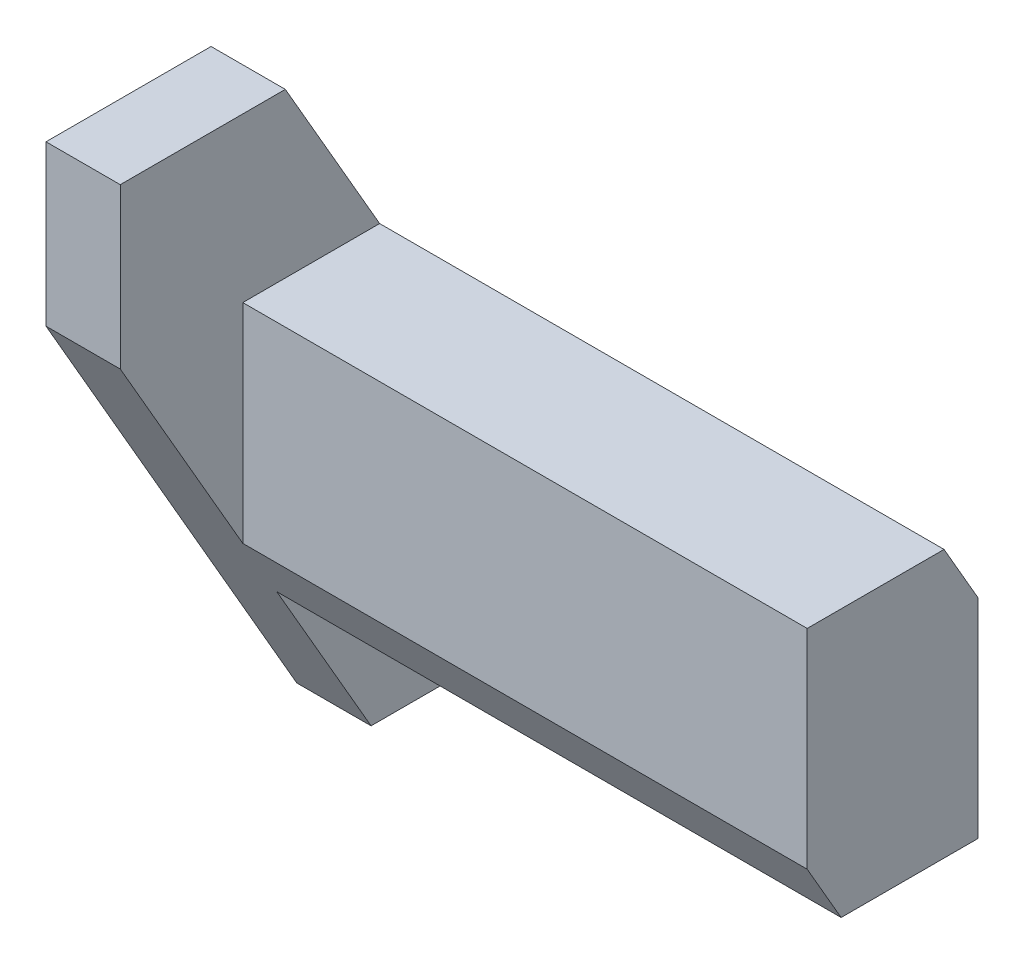
ISO-10303-21;
HEADER;
FILE_DESCRIPTION(('STEP AP214'),'2;1');
FILE_NAME('part.step','',(''),(''),'','','');
FILE_SCHEMA(('AUTOMOTIVE_DESIGN { 1 0 10303 214 1 1 1 1 }'));
ENDSEC;
DATA;
#1=APPLICATION_CONTEXT('core data for automotive mechanical design processes');
#2=APPLICATION_PROTOCOL_DEFINITION('international standard','automotive_design',2000,#1);
#3=PRODUCT_CONTEXT('',#1,'mechanical');
#4=PRODUCT('Part','Part','',(#3));
#5=PRODUCT_RELATED_PRODUCT_CATEGORY('part','',(#4));
#6=PRODUCT_DEFINITION_FORMATION('','',#4);
#7=PRODUCT_DEFINITION_CONTEXT('part definition',#1,'design');
#8=PRODUCT_DEFINITION('design','',#6,#7);
#9=PRODUCT_DEFINITION_SHAPE('','',#8);
#10=(LENGTH_UNIT() NAMED_UNIT(*) SI_UNIT(.MILLI.,.METRE.));
#11=(NAMED_UNIT(*) PLANE_ANGLE_UNIT() SI_UNIT($,.RADIAN.));
#12=(NAMED_UNIT(*) SI_UNIT($,.STERADIAN.) SOLID_ANGLE_UNIT());
#13=UNCERTAINTY_MEASURE_WITH_UNIT(LENGTH_MEASURE(1.E-05),#10,'distance_accuracy_value','');
#14=(GEOMETRIC_REPRESENTATION_CONTEXT(3) GLOBAL_UNCERTAINTY_ASSIGNED_CONTEXT((#13)) GLOBAL_UNIT_ASSIGNED_CONTEXT((#10,
#11,#12)) REPRESENTATION_CONTEXT('',''));
#15=CARTESIAN_POINT('',(0.,0.,0.));
#16=DIRECTION('',(0.,0.,1.));
#17=DIRECTION('',(1.,0.,0.));
#18=AXIS2_PLACEMENT_3D('',#15,#16,#17);
#19=CARTESIAN_POINT('',(0.,0.,0.));
#20=DIRECTION('',(1.,0.,0.));
#21=DIRECTION('',(0.,0.,-1.));
#22=AXIS2_PLACEMENT_3D('',#19,#20,#21);
#23=PLANE('',#22);
#24=DIRECTION('',(0.,-1.,0.));
#25=VECTOR('',#24,1.);
#26=CARTESIAN_POINT('',(0.,-10.0814157129578,11.5));
#27=LINE('',#26,#25);
#28=CARTESIAN_POINT('',(0.,18.,11.5));
#29=VERTEX_POINT('',#28);
#30=CARTESIAN_POINT('',(0.,-10.081415712958,11.5));
#31=VERTEX_POINT('',#30);
#32=EDGE_CURVE('E49',#29,#31,#27,.T.);
#33=ORIENTED_EDGE('',*,*,#32,.F.);
#34=DIRECTION('',(0.,0.,1.));
#35=VECTOR('',#34,1.);
#36=CARTESIAN_POINT('',(0.,18.,-6.92820323027544));
#37=LINE('',#36,#35);
#38=CARTESIAN_POINT('',(0.,18.,-6.92820323027556));
#39=VERTEX_POINT('',#38);
#40=EDGE_CURVE('E161',#39,#29,#37,.T.);
#41=ORIENTED_EDGE('',*,*,#40,.F.);
#42=DIRECTION('',(0.,0.86602540378444,0.499999999999998));
#43=VECTOR('',#42,1.);
#44=CARTESIAN_POINT('',(0.,-18.4974226119287,-28.));
#45=LINE('',#44,#43);
#46=CARTESIAN_POINT('',(0.,40.,5.77350269189616));
#47=VERTEX_POINT('',#46);
#48=EDGE_CURVE('E200',#39,#47,#45,.T.);
#49=ORIENTED_EDGE('',*,*,#48,.T.);
#50=DIRECTION('',(0.,0.,1.));
#51=VECTOR('',#50,1.);
#52=CARTESIAN_POINT('',(0.,40.,5.77350269189616));
#53=LINE('',#52,#51);
#54=CARTESIAN_POINT('',(0.,40.,28.));
#55=VERTEX_POINT('',#54);
#56=EDGE_CURVE('E210',#47,#55,#53,.T.);
#57=ORIENTED_EDGE('',*,*,#56,.T.);
#58=DIRECTION('',(0.,-1.,0.));
#59=VECTOR('',#58,1.);
#60=CARTESIAN_POINT('',(0.,18.4974226119287,28.));
#61=LINE('',#60,#59);
#62=CARTESIAN_POINT('',(0.,18.4974226119287,28.));
#63=VERTEX_POINT('',#62);
#64=EDGE_CURVE('E213',#55,#63,#61,.T.);
#65=ORIENTED_EDGE('',*,*,#64,.T.);
#66=DIRECTION('',(0.,-0.86602540378444,-0.499999999999998));
#67=VECTOR('',#66,1.);
#68=CARTESIAN_POINT('',(0.,-40.,-5.77350269189616));
#69=LINE('',#68,#67);
#70=EDGE_CURVE('E217',#63,#31,#69,.T.);
#71=ORIENTED_EDGE('',*,*,#70,.T.);
#72=EDGE_LOOP('',(#33,#41,#49,#57,#65,#71));
#73=FACE_BOUND('',#72,.T.);
#74=ADVANCED_FACE('F34',(#73),#23,.T.);
#75=CARTESIAN_POINT('',(-24.,-18.4974226119287,-28.));
#76=DIRECTION('',(0.,0.499999999999998,-0.86602540378444));
#77=DIRECTION('',(0.,0.86602540378444,0.499999999999998));
#78=AXIS2_PLACEMENT_3D('',#75,#76,#77);
#79=PLANE('',#78);
#80=DIRECTION('',(0.,-0.86602540378444,-0.499999999999998));
#81=VECTOR('',#80,1.);
#82=CARTESIAN_POINT('',(-9.99999999999999,-18.4974226119287,-28.));
#83=LINE('',#82,#81);
#84=CARTESIAN_POINT('',(-10.,40.,5.77350269189616));
#85=VERTEX_POINT('',#84);
#86=CARTESIAN_POINT('',(-9.99999999999999,-18.4974226119287,-28.));
#87=VERTEX_POINT('',#86);
#88=EDGE_CURVE('E198',#85,#87,#83,.T.);
#89=ORIENTED_EDGE('',*,*,#88,.F.);
#90=DIRECTION('',(1.,0.,0.));
#91=VECTOR('',#90,1.);
#92=CARTESIAN_POINT('',(-24.,40.,5.77350269189616));
#93=LINE('',#92,#91);
#94=EDGE_CURVE('E207',#85,#47,#93,.T.);
#95=ORIENTED_EDGE('',*,*,#94,.T.);
#96=ORIENTED_EDGE('',*,*,#48,.F.);
#97=DIRECTION('',(-1.,0.,0.));
#98=VECTOR('',#97,1.);
#99=CARTESIAN_POINT('',(76.,18.,-6.92820323027544));
#100=LINE('',#99,#98);
#101=CARTESIAN_POINT('',(76.,18.,-6.92820323027544));
#102=VERTEX_POINT('',#101);
#103=EDGE_CURVE('E255',#102,#39,#100,.T.);
#104=ORIENTED_EDGE('',*,*,#103,.F.);
#105=DIRECTION('',(0.,0.866025403784438,0.5));
#106=VECTOR('',#105,1.);
#107=CARTESIAN_POINT('',(76.,18.,-6.92820323027544));
#108=LINE('',#107,#106);
#109=CARTESIAN_POINT('',(76.,10.0814157129577,-11.5));
#110=VERTEX_POINT('',#109);
#111=EDGE_CURVE('E271',#110,#102,#108,.T.);
#112=ORIENTED_EDGE('',*,*,#111,.F.);
#113=DIRECTION('',(-1.,0.,0.));
#114=VECTOR('',#113,1.);
#115=CARTESIAN_POINT('',(76.,10.0814157129577,-11.5));
#116=LINE('',#115,#114);
#117=CARTESIAN_POINT('',(0.,10.0814157129579,-11.5));
#118=VERTEX_POINT('',#117);
#119=EDGE_CURVE('E257',#110,#118,#116,.T.);
#120=ORIENTED_EDGE('',*,*,#119,.T.);
#121=CARTESIAN_POINT('',(0.,-18.4974226119287,-28.));
#122=VERTEX_POINT('',#121);
#123=EDGE_CURVE('E208',#122,#118,#45,.T.);
#124=ORIENTED_EDGE('',*,*,#123,.F.);
#125=DIRECTION('',(1.,0.,0.));
#126=VECTOR('',#125,1.);
#127=CARTESIAN_POINT('',(-24.,-18.4974226119287,-28.));
#128=LINE('',#127,#126);
#129=EDGE_CURVE('E42',#87,#122,#128,.T.);
#130=ORIENTED_EDGE('',*,*,#129,.F.);
#131=EDGE_LOOP('',(#89,#95,#96,#104,#112,#120,#124,#130));
#132=FACE_BOUND('',#131,.T.);
#133=ADVANCED_FACE('F36',(#132),#79,.T.);
#134=CARTESIAN_POINT('',(-24.,-40.,-28.));
#135=DIRECTION('',(0.,0.,-1.));
#136=DIRECTION('',(0.,1.,0.));
#137=AXIS2_PLACEMENT_3D('',#134,#135,#136);
#138=PLANE('',#137);
#139=DIRECTION('',(0.,1.,0.));
#140=VECTOR('',#139,1.);
#141=CARTESIAN_POINT('',(-10.,40.,-28.));
#142=LINE('',#141,#140);
#143=CARTESIAN_POINT('',(-9.99999999999999,-20.,-28.));
#144=VERTEX_POINT('',#143);
#145=EDGE_CURVE('E182',#144,#87,#142,.T.);
#146=ORIENTED_EDGE('',*,*,#145,.T.);
#147=ORIENTED_EDGE('',*,*,#129,.T.);
#148=DIRECTION('',(0.,1.,0.));
#149=VECTOR('',#148,1.);
#150=CARTESIAN_POINT('',(0.,-40.,-28.));
#151=LINE('',#150,#149);
#152=CARTESIAN_POINT('',(0.,-40.,-28.));
#153=VERTEX_POINT('',#152);
#154=EDGE_CURVE('E204',#153,#122,#151,.T.);
#155=ORIENTED_EDGE('',*,*,#154,.F.);
#156=DIRECTION('',(1.,0.,0.));
#157=VECTOR('',#156,1.);
#158=CARTESIAN_POINT('',(-24.,-40.,-28.));
#159=LINE('',#158,#157);
#160=CARTESIAN_POINT('',(-24.,-40.,-28.));
#161=VERTEX_POINT('',#160);
#162=EDGE_CURVE('E225',#161,#153,#159,.T.);
#163=ORIENTED_EDGE('',*,*,#162,.F.);
#164=DIRECTION('',(0.,1.,0.));
#165=VECTOR('',#164,1.);
#166=CARTESIAN_POINT('',(-24.,-40.,-28.));
#167=LINE('',#166,#165);
#168=CARTESIAN_POINT('',(-24.,-24.,-28.));
#169=VERTEX_POINT('',#168);
#170=EDGE_CURVE('E203',#161,#169,#167,.T.);
#171=ORIENTED_EDGE('',*,*,#170,.T.);
#172=DIRECTION('',(0.961523947640823,0.274721127897378,0.));
#173=VECTOR('',#172,1.);
#174=CARTESIAN_POINT('',(-9.99999999999999,-20.,-28.));
#175=LINE('',#174,#173);
#176=EDGE_CURVE('E179',#169,#144,#175,.T.);
#177=ORIENTED_EDGE('',*,*,#176,.T.);
#178=EDGE_LOOP('',(#146,#147,#155,#163,#171,#177));
#179=FACE_BOUND('',#178,.T.);
#180=ADVANCED_FACE('F291',(#179),#138,.T.);
#181=CARTESIAN_POINT('',(-24.,-40.,-5.77350269189616));
#182=DIRECTION('',(0.,-1.,0.));
#183=DIRECTION('',(0.,0.,-1.));
#184=AXIS2_PLACEMENT_3D('',#181,#182,#183);
#185=PLANE('',#184);
#186=DIRECTION('',(0.,0.,1.));
#187=VECTOR('',#186,1.);
#188=CARTESIAN_POINT('',(-9.99999999999999,-40.,-5.77350269189616));
#189=LINE('',#188,#187);
#190=CARTESIAN_POINT('',(-9.99999999999999,-40.,-8.));
#191=VERTEX_POINT('',#190);
#192=CARTESIAN_POINT('',(-9.99999999999999,-40.,-5.77350269189616));
#193=VERTEX_POINT('',#192);
#194=EDGE_CURVE('E176',#191,#193,#189,.T.);
#195=ORIENTED_EDGE('',*,*,#194,.F.);
#196=DIRECTION('',(0.961523947640823,0.,0.274721127897378));
#197=VECTOR('',#196,1.);
#198=CARTESIAN_POINT('',(-22.3552648620103,-40.,-11.5300756748601));
#199=LINE('',#198,#197);
#200=CARTESIAN_POINT('',(-24.,-40.,-12.));
#201=VERTEX_POINT('',#200);
#202=EDGE_CURVE('E173',#201,#191,#199,.T.);
#203=ORIENTED_EDGE('',*,*,#202,.F.);
#204=DIRECTION('',(0.,0.,-1.));
#205=VECTOR('',#204,1.);
#206=CARTESIAN_POINT('',(-24.,-40.,-5.77350269189616));
#207=LINE('',#206,#205);
#208=EDGE_CURVE('E201',#201,#161,#207,.T.);
#209=ORIENTED_EDGE('',*,*,#208,.T.);
#210=ORIENTED_EDGE('',*,*,#162,.T.);
#211=DIRECTION('',(0.,0.,-1.));
#212=VECTOR('',#211,1.);
#213=CARTESIAN_POINT('',(0.,-40.,-5.77350269189616));
#214=LINE('',#213,#212);
#215=CARTESIAN_POINT('',(0.,-40.,-5.77350269189616));
#216=VERTEX_POINT('',#215);
#217=EDGE_CURVE('E219',#216,#153,#214,.T.);
#218=ORIENTED_EDGE('',*,*,#217,.F.);
#219=DIRECTION('',(1.,0.,0.));
#220=VECTOR('',#219,1.);
#221=CARTESIAN_POINT('',(-24.,-40.,-5.77350269189616));
#222=LINE('',#221,#220);
#223=EDGE_CURVE('E227',#193,#216,#222,.T.);
#224=ORIENTED_EDGE('',*,*,#223,.F.);
#225=EDGE_LOOP('',(#195,#203,#209,#210,#218,#224));
#226=FACE_BOUND('',#225,.T.);
#227=ADVANCED_FACE('F318',(#226),#185,.T.);
#228=CARTESIAN_POINT('',(-24.,-40.,-5.77350269189616));
#229=DIRECTION('',(0.,-0.499999999999998,0.86602540378444));
#230=DIRECTION('',(0.,-0.86602540378444,-0.499999999999998));
#231=AXIS2_PLACEMENT_3D('',#228,#229,#230);
#232=PLANE('',#231);
#233=DIRECTION('',(0.,0.86602540378444,0.499999999999998));
#234=VECTOR('',#233,1.);
#235=CARTESIAN_POINT('',(-9.99999999999999,-40.,-5.77350269189616));
#236=LINE('',#235,#234);
#237=CARTESIAN_POINT('',(-10.,18.4974226119287,28.));
#238=VERTEX_POINT('',#237);
#239=EDGE_CURVE('E196',#193,#238,#236,.T.);
#240=ORIENTED_EDGE('',*,*,#239,.F.);
#241=ORIENTED_EDGE('',*,*,#223,.T.);
#242=CARTESIAN_POINT('',(0.,-18.,6.92820323027554));
#243=VERTEX_POINT('',#242);
#244=EDGE_CURVE('E216',#243,#216,#69,.T.);
#245=ORIENTED_EDGE('',*,*,#244,.F.);
#246=DIRECTION('',(-1.,0.,0.));
#247=VECTOR('',#246,1.);
#248=CARTESIAN_POINT('',(76.,-18.,6.92820323027544));
#249=LINE('',#248,#247);
#250=CARTESIAN_POINT('',(76.,-18.,6.92820323027544));
#251=VERTEX_POINT('',#250);
#252=EDGE_CURVE('E148',#251,#243,#249,.T.);
#253=ORIENTED_EDGE('',*,*,#252,.F.);
#254=DIRECTION('',(0.,-0.866025403784439,-0.5));
#255=VECTOR('',#254,1.);
#256=CARTESIAN_POINT('',(76.,-10.0814157129578,11.5));
#257=LINE('',#256,#255);
#258=CARTESIAN_POINT('',(76.,-10.0814157129578,11.5));
#259=VERTEX_POINT('',#258);
#260=EDGE_CURVE('E141',#259,#251,#257,.T.);
#261=ORIENTED_EDGE('',*,*,#260,.F.);
#262=DIRECTION('',(-1.,0.,0.));
#263=VECTOR('',#262,1.);
#264=CARTESIAN_POINT('',(76.,-10.0814157129578,11.5));
#265=LINE('',#264,#263);
#266=EDGE_CURVE('E146',#259,#31,#265,.T.);
#267=ORIENTED_EDGE('',*,*,#266,.T.);
#268=ORIENTED_EDGE('',*,*,#70,.F.);
#269=DIRECTION('',(1.,0.,0.));
#270=VECTOR('',#269,1.);
#271=CARTESIAN_POINT('',(-24.,18.4974226119287,28.));
#272=LINE('',#271,#270);
#273=EDGE_CURVE('E230',#238,#63,#272,.T.);
#274=ORIENTED_EDGE('',*,*,#273,.F.);
#275=EDGE_LOOP('',(#240,#241,#245,#253,#261,#267,#268,#274));
#276=FACE_BOUND('',#275,.T.);
#277=ADVANCED_FACE('F143',(#276),#232,.T.);
#278=CARTESIAN_POINT('',(-24.,18.4974226119287,28.));
#279=DIRECTION('',(0.,0.,1.));
#280=DIRECTION('',(0.,-1.,0.));
#281=AXIS2_PLACEMENT_3D('',#278,#279,#280);
#282=PLANE('',#281);
#283=DIRECTION('',(0.,1.,0.));
#284=VECTOR('',#283,1.);
#285=CARTESIAN_POINT('',(-10.,18.4974226119287,28.));
#286=LINE('',#285,#284);
#287=CARTESIAN_POINT('',(-10.,40.,28.));
#288=VERTEX_POINT('',#287);
#289=EDGE_CURVE('E189',#238,#288,#286,.T.);
#290=ORIENTED_EDGE('',*,*,#289,.F.);
#291=ORIENTED_EDGE('',*,*,#273,.T.);
#292=ORIENTED_EDGE('',*,*,#64,.F.);
#293=DIRECTION('',(1.,0.,0.));
#294=VECTOR('',#293,1.);
#295=CARTESIAN_POINT('',(-24.,40.,28.));
#296=LINE('',#295,#294);
#297=EDGE_CURVE('E232',#288,#55,#296,.T.);
#298=ORIENTED_EDGE('',*,*,#297,.F.);
#299=EDGE_LOOP('',(#290,#291,#292,#298));
#300=FACE_BOUND('',#299,.T.);
#301=ADVANCED_FACE('F311',(#300),#282,.T.);
#302=CARTESIAN_POINT('',(-24.,40.,5.77350269189616));
#303=DIRECTION('',(0.,1.,0.));
#304=DIRECTION('',(0.,0.,1.));
#305=AXIS2_PLACEMENT_3D('',#302,#303,#304);
#306=PLANE('',#305);
#307=DIRECTION('',(0.,0.,1.));
#308=VECTOR('',#307,1.);
#309=CARTESIAN_POINT('',(-10.,40.,-28.));
#310=LINE('',#309,#308);
#311=EDGE_CURVE('E186',#85,#288,#310,.T.);
#312=ORIENTED_EDGE('',*,*,#311,.T.);
#313=ORIENTED_EDGE('',*,*,#297,.T.);
#314=ORIENTED_EDGE('',*,*,#56,.F.);
#315=ORIENTED_EDGE('',*,*,#94,.F.);
#316=EDGE_LOOP('',(#312,#313,#314,#315));
#317=FACE_BOUND('',#316,.T.);
#318=ADVANCED_FACE('F243',(#317),#306,.T.);
#319=CARTESIAN_POINT('',(-24.,0.,0.));
#320=DIRECTION('',(1.,0.,0.));
#321=DIRECTION('',(0.,0.,-1.));
#322=AXIS2_PLACEMENT_3D('',#319,#320,#321);
#323=PLANE('',#322);
#324=ORIENTED_EDGE('',*,*,#208,.F.);
#325=DIRECTION('',(0.,-1.,0.));
#326=VECTOR('',#325,1.);
#327=CARTESIAN_POINT('',(-24.,40.,-12.));
#328=LINE('',#327,#326);
#329=CARTESIAN_POINT('',(-24.,-24.,-12.));
#330=VERTEX_POINT('',#329);
#331=EDGE_CURVE('E164',#330,#201,#328,.T.);
#332=ORIENTED_EDGE('',*,*,#331,.F.);
#333=DIRECTION('',(0.,0.,1.));
#334=VECTOR('',#333,1.);
#335=CARTESIAN_POINT('',(-24.,-24.,-28.));
#336=LINE('',#335,#334);
#337=EDGE_CURVE('E185',#169,#330,#336,.T.);
#338=ORIENTED_EDGE('',*,*,#337,.F.);
#339=ORIENTED_EDGE('',*,*,#170,.F.);
#340=EDGE_LOOP('',(#324,#332,#338,#339));
#341=FACE_BOUND('',#340,.T.);
#342=ADVANCED_FACE('F296',(#341),#323,.F.);
#343=DIRECTION('',(0.,1.,0.));
#344=VECTOR('',#343,1.);
#345=CARTESIAN_POINT('',(0.,-18.,-11.5));
#346=LINE('',#345,#344);
#347=CARTESIAN_POINT('',(0.,-18.,-11.5));
#348=VERTEX_POINT('',#347);
#349=EDGE_CURVE('E247',#348,#118,#346,.T.);
#350=ORIENTED_EDGE('',*,*,#349,.F.);
#351=DIRECTION('',(0.,0.,-1.));
#352=VECTOR('',#351,1.);
#353=CARTESIAN_POINT('',(0.,-18.,-11.5));
#354=LINE('',#353,#352);
#355=EDGE_CURVE('E57',#243,#348,#354,.T.);
#356=ORIENTED_EDGE('',*,*,#355,.F.);
#357=ORIENTED_EDGE('',*,*,#244,.T.);
#358=ORIENTED_EDGE('',*,*,#217,.T.);
#359=ORIENTED_EDGE('',*,*,#154,.T.);
#360=ORIENTED_EDGE('',*,*,#123,.T.);
#361=EDGE_LOOP('',(#350,#356,#357,#358,#359,#360));
#362=FACE_BOUND('',#361,.T.);
#363=ADVANCED_FACE('F287',(#362),#23,.T.);
#364=CARTESIAN_POINT('',(-10.,40.,-28.));
#365=DIRECTION('',(1.,0.,0.));
#366=DIRECTION('',(0.,1.,0.));
#367=AXIS2_PLACEMENT_3D('',#364,#365,#366);
#368=PLANE('',#367);
#369=DIRECTION('',(0.,0.,1.));
#370=VECTOR('',#369,1.);
#371=CARTESIAN_POINT('',(-9.99999999999999,-20.,-28.));
#372=LINE('',#371,#370);
#373=CARTESIAN_POINT('',(-9.99999999999999,-20.,-8.00000000000001));
#374=VERTEX_POINT('',#373);
#375=EDGE_CURVE('E190',#144,#374,#372,.T.);
#376=ORIENTED_EDGE('',*,*,#375,.T.);
#377=DIRECTION('',(0.,-1.,0.));
#378=VECTOR('',#377,1.);
#379=CARTESIAN_POINT('',(-9.99999999999999,40.,-8.00000000000003));
#380=LINE('',#379,#378);
#381=EDGE_CURVE('E166',#374,#191,#380,.T.);
#382=ORIENTED_EDGE('',*,*,#381,.T.);
#383=ORIENTED_EDGE('',*,*,#194,.T.);
#384=ORIENTED_EDGE('',*,*,#239,.T.);
#385=ORIENTED_EDGE('',*,*,#289,.T.);
#386=ORIENTED_EDGE('',*,*,#311,.F.);
#387=ORIENTED_EDGE('',*,*,#88,.T.);
#388=ORIENTED_EDGE('',*,*,#145,.F.);
#389=EDGE_LOOP('',(#376,#382,#383,#384,#385,#386,#387,#388));
#390=FACE_BOUND('',#389,.T.);
#391=ADVANCED_FACE('F295',(#390),#368,.F.);
#392=CARTESIAN_POINT('',(-9.99999999999999,-20.,-28.));
#393=DIRECTION('',(0.274721127897378,-0.961523947640823,0.));
#394=DIRECTION('',(0.961523947640823,0.274721127897378,0.));
#395=AXIS2_PLACEMENT_3D('',#392,#393,#394);
#396=PLANE('',#395);
#397=ORIENTED_EDGE('',*,*,#337,.T.);
#398=DIRECTION('',(0.927172649945531,0.264906471413009,0.264906471413009));
#399=VECTOR('',#398,1.);
#400=CARTESIAN_POINT('',(-14.9122807017544,-21.4035087719298,-9.40350877192983));
#401=LINE('',#400,#399);
#402=EDGE_CURVE('E11',#330,#374,#401,.T.);
#403=ORIENTED_EDGE('',*,*,#402,.T.);
#404=ORIENTED_EDGE('',*,*,#375,.F.);
#405=ORIENTED_EDGE('',*,*,#176,.F.);
#406=EDGE_LOOP('',(#397,#403,#404,#405));
#407=FACE_BOUND('',#406,.T.);
#408=ADVANCED_FACE('F301',(#407),#396,.F.);
#409=CARTESIAN_POINT('',(-9.99999999999999,40.,-8.00000000000003));
#410=DIRECTION('',(0.274721127897378,0.,-0.961523947640823));
#411=DIRECTION('',(-0.961523947640823,0.,-0.274721127897378));
#412=AXIS2_PLACEMENT_3D('',#409,#410,#411);
#413=PLANE('',#412);
#414=ORIENTED_EDGE('',*,*,#202,.T.);
#415=ORIENTED_EDGE('',*,*,#381,.F.);
#416=ORIENTED_EDGE('',*,*,#402,.F.);
#417=ORIENTED_EDGE('',*,*,#331,.T.);
#418=EDGE_LOOP('',(#414,#415,#416,#417));
#419=FACE_BOUND('',#418,.T.);
#420=ADVANCED_FACE('F325',(#419),#413,.F.);
#421=CARTESIAN_POINT('',(76.,-10.0814157129578,11.5));
#422=DIRECTION('',(0.,0.,-1.));
#423=DIRECTION('',(0.,1.,0.));
#424=AXIS2_PLACEMENT_3D('',#421,#422,#423);
#425=PLANE('',#424);
#426=ORIENTED_EDGE('',*,*,#32,.T.);
#427=ORIENTED_EDGE('',*,*,#266,.F.);
#428=DIRECTION('',(0.,-1.,0.));
#429=VECTOR('',#428,1.);
#430=CARTESIAN_POINT('',(76.,-10.0814157129578,11.5));
#431=LINE('',#430,#429);
#432=CARTESIAN_POINT('',(76.,18.,11.5));
#433=VERTEX_POINT('',#432);
#434=EDGE_CURVE('E152',#433,#259,#431,.T.);
#435=ORIENTED_EDGE('',*,*,#434,.F.);
#436=DIRECTION('',(-1.,0.,0.));
#437=VECTOR('',#436,1.);
#438=CARTESIAN_POINT('',(76.,18.,11.5));
#439=LINE('',#438,#437);
#440=EDGE_CURVE('E253',#433,#29,#439,.T.);
#441=ORIENTED_EDGE('',*,*,#440,.T.);
#442=EDGE_LOOP('',(#426,#427,#435,#441));
#443=FACE_BOUND('',#442,.T.);
#444=ADVANCED_FACE('F163',(#443),#425,.F.);
#445=CARTESIAN_POINT('',(76.,-18.,-11.5));
#446=DIRECTION('',(0.,1.,0.));
#447=DIRECTION('',(0.,0.,1.));
#448=AXIS2_PLACEMENT_3D('',#445,#446,#447);
#449=PLANE('',#448);
#450=ORIENTED_EDGE('',*,*,#355,.T.);
#451=DIRECTION('',(-1.,0.,0.));
#452=VECTOR('',#451,1.);
#453=CARTESIAN_POINT('',(76.,-18.,-11.5));
#454=LINE('',#453,#452);
#455=CARTESIAN_POINT('',(76.,-18.,-11.5));
#456=VERTEX_POINT('',#455);
#457=EDGE_CURVE('E168',#456,#348,#454,.T.);
#458=ORIENTED_EDGE('',*,*,#457,.F.);
#459=DIRECTION('',(0.,0.,-1.));
#460=VECTOR('',#459,1.);
#461=CARTESIAN_POINT('',(76.,-18.,-11.5));
#462=LINE('',#461,#460);
#463=EDGE_CURVE('E151',#251,#456,#462,.T.);
#464=ORIENTED_EDGE('',*,*,#463,.F.);
#465=ORIENTED_EDGE('',*,*,#252,.T.);
#466=EDGE_LOOP('',(#450,#458,#464,#465));
#467=FACE_BOUND('',#466,.T.);
#468=ADVANCED_FACE('F267',(#467),#449,.F.);
#469=CARTESIAN_POINT('',(76.,-18.,-11.5));
#470=DIRECTION('',(0.,0.,1.));
#471=DIRECTION('',(0.,-1.,0.));
#472=AXIS2_PLACEMENT_3D('',#469,#470,#471);
#473=PLANE('',#472);
#474=ORIENTED_EDGE('',*,*,#349,.T.);
#475=ORIENTED_EDGE('',*,*,#119,.F.);
#476=DIRECTION('',(0.,1.,0.));
#477=VECTOR('',#476,1.);
#478=CARTESIAN_POINT('',(76.,-18.,-11.5));
#479=LINE('',#478,#477);
#480=EDGE_CURVE('E265',#456,#110,#479,.T.);
#481=ORIENTED_EDGE('',*,*,#480,.F.);
#482=ORIENTED_EDGE('',*,*,#457,.T.);
#483=EDGE_LOOP('',(#474,#475,#481,#482));
#484=FACE_BOUND('',#483,.T.);
#485=ADVANCED_FACE('F263',(#484),#473,.F.);
#486=CARTESIAN_POINT('',(76.,18.,-6.92820323027544));
#487=DIRECTION('',(0.,-1.,0.));
#488=DIRECTION('',(0.,0.,-1.));
#489=AXIS2_PLACEMENT_3D('',#486,#487,#488);
#490=PLANE('',#489);
#491=ORIENTED_EDGE('',*,*,#40,.T.);
#492=ORIENTED_EDGE('',*,*,#440,.F.);
#493=DIRECTION('',(0.,0.,1.));
#494=VECTOR('',#493,1.);
#495=CARTESIAN_POINT('',(76.,18.,-6.92820323027544));
#496=LINE('',#495,#494);
#497=EDGE_CURVE('E157',#102,#433,#496,.T.);
#498=ORIENTED_EDGE('',*,*,#497,.F.);
#499=ORIENTED_EDGE('',*,*,#103,.T.);
#500=EDGE_LOOP('',(#491,#492,#498,#499));
#501=FACE_BOUND('',#500,.T.);
#502=ADVANCED_FACE('F276',(#501),#490,.F.);
#503=CARTESIAN_POINT('',(76.,0.,0.));
#504=DIRECTION('',(1.,0.,0.));
#505=DIRECTION('',(0.,0.,-1.));
#506=AXIS2_PLACEMENT_3D('',#503,#504,#505);
#507=PLANE('',#506);
#508=ORIENTED_EDGE('',*,*,#434,.T.);
#509=ORIENTED_EDGE('',*,*,#260,.T.);
#510=ORIENTED_EDGE('',*,*,#463,.T.);
#511=ORIENTED_EDGE('',*,*,#480,.T.);
#512=ORIENTED_EDGE('',*,*,#111,.T.);
#513=ORIENTED_EDGE('',*,*,#497,.T.);
#514=EDGE_LOOP('',(#508,#509,#510,#511,#512,#513));
#515=FACE_BOUND('',#514,.T.);
#516=ADVANCED_FACE('F155',(#515),#507,.T.);
#517=CLOSED_SHELL('',(#74,#133,#180,#227,#277,#301,#318,#342,#363,#391,#408,#420,#444,#468,#485,
#502,#516));
#518=MANIFOLD_SOLID_BREP('B2',#517);
#519=ADVANCED_BREP_SHAPE_REPRESENTATION('',(#18,#518),#14);
#520=SHAPE_DEFINITION_REPRESENTATION(#9,#519);
ENDSEC;
END-ISO-10303-21;
